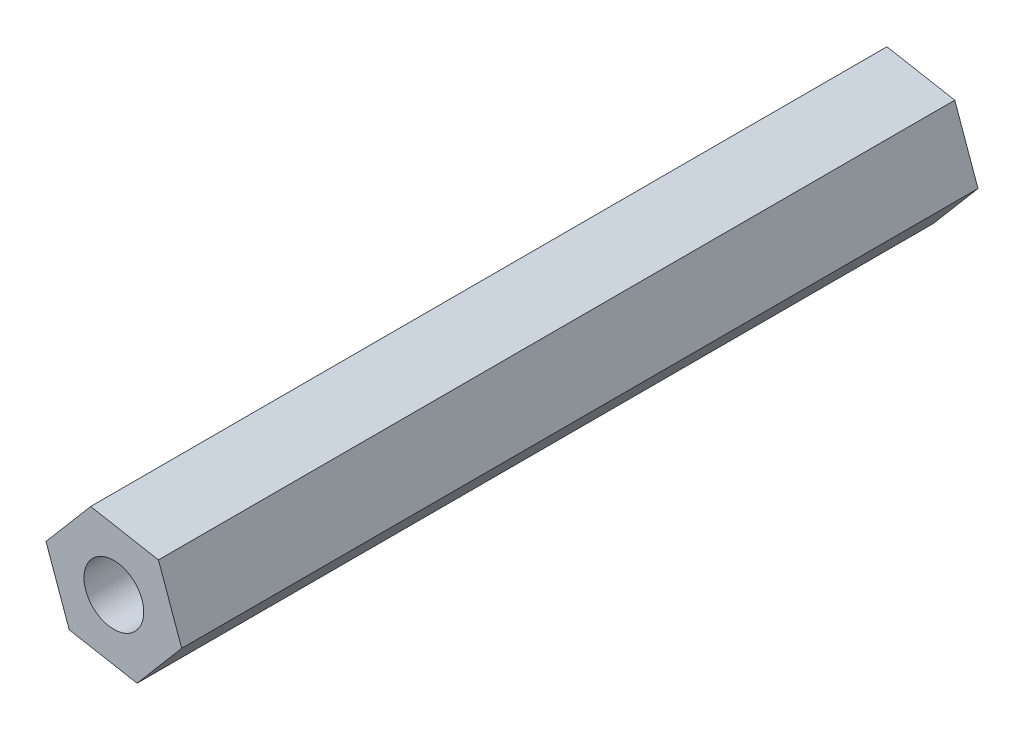
ISO-10303-21;
HEADER;
FILE_DESCRIPTION(('STEP AP214'),'2;1');
FILE_NAME('part.step','',(''),(''),'','','');
FILE_SCHEMA(('AUTOMOTIVE_DESIGN { 1 0 10303 214 1 1 1 1 }'));
ENDSEC;
DATA;
#1=APPLICATION_CONTEXT('core data for automotive mechanical design processes');
#2=APPLICATION_PROTOCOL_DEFINITION('international standard','automotive_design',2000,#1);
#3=PRODUCT_CONTEXT('',#1,'mechanical');
#4=PRODUCT('Part','Part','',(#3));
#5=PRODUCT_RELATED_PRODUCT_CATEGORY('part','',(#4));
#6=PRODUCT_DEFINITION_FORMATION('','',#4);
#7=PRODUCT_DEFINITION_CONTEXT('part definition',#1,'design');
#8=PRODUCT_DEFINITION('design','',#6,#7);
#9=PRODUCT_DEFINITION_SHAPE('','',#8);
#10=(LENGTH_UNIT() NAMED_UNIT(*) SI_UNIT(.MILLI.,.METRE.));
#11=(NAMED_UNIT(*) PLANE_ANGLE_UNIT() SI_UNIT($,.RADIAN.));
#12=(NAMED_UNIT(*) SI_UNIT($,.STERADIAN.) SOLID_ANGLE_UNIT());
#13=UNCERTAINTY_MEASURE_WITH_UNIT(LENGTH_MEASURE(1.E-05),#10,'distance_accuracy_value','');
#14=(GEOMETRIC_REPRESENTATION_CONTEXT(3) GLOBAL_UNCERTAINTY_ASSIGNED_CONTEXT((#13)) GLOBAL_UNIT_ASSIGNED_CONTEXT((#10,
#11,#12)) REPRESENTATION_CONTEXT('',''));
#15=CARTESIAN_POINT('',(0.,0.,0.));
#16=DIRECTION('',(0.,0.,1.));
#17=DIRECTION('',(1.,0.,0.));
#18=AXIS2_PLACEMENT_3D('',#15,#16,#17);
#19=CARTESIAN_POINT('',(14.100105118259,-7.40552271774973,40.));
#20=DIRECTION('',(-0.941553473498977,-0.336863557753005,0.));
#21=DIRECTION('',(0.336863557753005,-0.941553473498977,0.));
#22=AXIS2_PLACEMENT_3D('',#19,#20,#21);
#23=PLANE('',#22);
#24=DIRECTION('',(-0.336863557753005,0.941553473498977,0.));
#25=VECTOR('',#24,1.);
#26=CARTESIAN_POINT('',(14.100105118259,-7.40552271774973,0.));
#27=LINE('',#26,#25);
#28=CARTESIAN_POINT('',(14.100105118259,-7.40552271774973,0.));
#29=VERTEX_POINT('',#28);
#30=CARTESIAN_POINT('',(12.9331755237658,-4.14388580946336,0.));
#31=VERTEX_POINT('',#30);
#32=EDGE_CURVE('E117',#29,#31,#27,.T.);
#33=ORIENTED_EDGE('',*,*,#32,.T.);
#34=DIRECTION('',(0.,0.,-1.));
#35=VECTOR('',#34,1.);
#36=CARTESIAN_POINT('',(12.9331755237658,-4.14388580946336,40.));
#37=LINE('',#36,#35);
#38=CARTESIAN_POINT('',(12.9331755237658,-4.14388580946336,40.));
#39=VERTEX_POINT('',#38);
#40=EDGE_CURVE('E11',#39,#31,#37,.T.);
#41=ORIENTED_EDGE('',*,*,#40,.F.);
#42=DIRECTION('',(-0.336863557753005,0.941553473498977,0.));
#43=VECTOR('',#42,1.);
#44=CARTESIAN_POINT('',(14.100105118259,-7.40552271774973,40.));
#45=LINE('',#44,#43);
#46=CARTESIAN_POINT('',(14.100105118259,-7.40552271774973,40.));
#47=VERTEX_POINT('',#46);
#48=EDGE_CURVE('E128',#47,#39,#45,.T.);
#49=ORIENTED_EDGE('',*,*,#48,.F.);
#50=DIRECTION('',(0.,0.,-1.));
#51=VECTOR('',#50,1.);
#52=CARTESIAN_POINT('',(14.100105118259,-7.40552271774973,40.));
#53=LINE('',#52,#51);
#54=EDGE_CURVE('E113',#47,#29,#53,.T.);
#55=ORIENTED_EDGE('',*,*,#54,.T.);
#56=EDGE_LOOP('',(#33,#41,#49,#55));
#57=FACE_BOUND('',#56,.T.);
#58=ADVANCED_FACE('F33',(#57),#23,.F.);
#59=CARTESIAN_POINT('',(12.9331755237658,-4.14388580946336,40.));
#60=DIRECTION('',(-0.17904433812618,-0.983841005948094,0.));
#61=DIRECTION('',(0.983841005948094,-0.17904433812618,0.));
#62=AXIS2_PLACEMENT_3D('',#59,#60,#61);
#63=PLANE('',#62);
#64=DIRECTION('',(-0.983841005948094,0.17904433812618,0.));
#65=VECTOR('',#64,1.);
#66=CARTESIAN_POINT('',(12.9331755237658,-4.14388580946336,0.));
#67=LINE('',#66,#65);
#68=CARTESIAN_POINT('',(9.52505030602222,-3.52365802857919,0.));
#69=VERTEX_POINT('',#68);
#70=EDGE_CURVE('E120',#31,#69,#67,.T.);
#71=ORIENTED_EDGE('',*,*,#70,.T.);
#72=DIRECTION('',(0.,0.,-1.));
#73=VECTOR('',#72,1.);
#74=CARTESIAN_POINT('',(9.52505030602222,-3.52365802857919,40.));
#75=LINE('',#74,#73);
#76=CARTESIAN_POINT('',(9.52505030602222,-3.52365802857919,40.));
#77=VERTEX_POINT('',#76);
#78=EDGE_CURVE('E41',#77,#69,#75,.T.);
#79=ORIENTED_EDGE('',*,*,#78,.F.);
#80=DIRECTION('',(-0.983841005948094,0.17904433812618,0.));
#81=VECTOR('',#80,1.);
#82=CARTESIAN_POINT('',(12.9331755237658,-4.14388580946336,40.));
#83=LINE('',#82,#81);
#84=EDGE_CURVE('E86',#39,#77,#83,.T.);
#85=ORIENTED_EDGE('',*,*,#84,.F.);
#86=ORIENTED_EDGE('',*,*,#40,.T.);
#87=EDGE_LOOP('',(#71,#79,#85,#86));
#88=FACE_BOUND('',#87,.T.);
#89=ADVANCED_FACE('F153',(#88),#63,.F.);
#90=CARTESIAN_POINT('',(9.52505030602222,-3.52365802857919,40.));
#91=DIRECTION('',(0.762509135372797,-0.64697744819509,0.));
#92=DIRECTION('',(0.64697744819509,0.762509135372797,0.));
#93=AXIS2_PLACEMENT_3D('',#90,#91,#92);
#94=PLANE('',#93);
#95=DIRECTION('',(-0.64697744819509,-0.762509135372797,0.));
#96=VECTOR('',#95,1.);
#97=CARTESIAN_POINT('',(9.52505030602222,-3.52365802857919,0.));
#98=LINE('',#97,#96);
#99=CARTESIAN_POINT('',(7.28385468277191,-6.16506715598138,0.));
#100=VERTEX_POINT('',#99);
#101=EDGE_CURVE('E123',#69,#100,#98,.T.);
#102=ORIENTED_EDGE('',*,*,#101,.T.);
#103=DIRECTION('',(0.,0.,-1.));
#104=VECTOR('',#103,1.);
#105=CARTESIAN_POINT('',(7.28385468277191,-6.16506715598138,40.));
#106=LINE('',#105,#104);
#107=CARTESIAN_POINT('',(7.28385468277191,-6.16506715598138,40.));
#108=VERTEX_POINT('',#107);
#109=EDGE_CURVE('E108',#108,#100,#106,.T.);
#110=ORIENTED_EDGE('',*,*,#109,.F.);
#111=DIRECTION('',(-0.64697744819509,-0.762509135372797,0.));
#112=VECTOR('',#111,1.);
#113=CARTESIAN_POINT('',(9.52505030602222,-3.52365802857919,40.));
#114=LINE('',#113,#112);
#115=EDGE_CURVE('E99',#77,#108,#114,.T.);
#116=ORIENTED_EDGE('',*,*,#115,.F.);
#117=ORIENTED_EDGE('',*,*,#78,.T.);
#118=EDGE_LOOP('',(#102,#110,#116,#117));
#119=FACE_BOUND('',#118,.T.);
#120=ADVANCED_FACE('F134',(#119),#94,.F.);
#121=CARTESIAN_POINT('',(7.28385468277191,-6.16506715598138,40.));
#122=DIRECTION('',(0.941553473498977,0.336863557753005,0.));
#123=DIRECTION('',(-0.336863557753005,0.941553473498977,0.));
#124=AXIS2_PLACEMENT_3D('',#121,#122,#123);
#125=PLANE('',#124);
#126=DIRECTION('',(0.336863557753005,-0.941553473498977,0.));
#127=VECTOR('',#126,1.);
#128=CARTESIAN_POINT('',(7.28385468277191,-6.16506715598138,0.));
#129=LINE('',#128,#127);
#130=CARTESIAN_POINT('',(8.45078427726515,-9.42670406426776,0.));
#131=VERTEX_POINT('',#130);
#132=EDGE_CURVE('E107',#100,#131,#129,.T.);
#133=ORIENTED_EDGE('',*,*,#132,.T.);
#134=DIRECTION('',(0.,0.,-1.));
#135=VECTOR('',#134,1.);
#136=CARTESIAN_POINT('',(8.45078427726515,-9.42670406426776,40.));
#137=LINE('',#136,#135);
#138=CARTESIAN_POINT('',(8.45078427726515,-9.42670406426776,40.));
#139=VERTEX_POINT('',#138);
#140=EDGE_CURVE('E104',#139,#131,#137,.T.);
#141=ORIENTED_EDGE('',*,*,#140,.F.);
#142=DIRECTION('',(0.336863557753005,-0.941553473498977,0.));
#143=VECTOR('',#142,1.);
#144=CARTESIAN_POINT('',(7.28385468277191,-6.16506715598138,40.));
#145=LINE('',#144,#143);
#146=EDGE_CURVE('E93',#108,#139,#145,.T.);
#147=ORIENTED_EDGE('',*,*,#146,.F.);
#148=ORIENTED_EDGE('',*,*,#109,.T.);
#149=EDGE_LOOP('',(#133,#141,#147,#148));
#150=FACE_BOUND('',#149,.T.);
#151=ADVANCED_FACE('F105',(#150),#125,.F.);
#152=CARTESIAN_POINT('',(8.45078427726515,-9.42670406426776,40.));
#153=DIRECTION('',(0.17904433812618,0.983841005948094,0.));
#154=DIRECTION('',(-0.983841005948094,0.17904433812618,0.));
#155=AXIS2_PLACEMENT_3D('',#152,#153,#154);
#156=PLANE('',#155);
#157=DIRECTION('',(0.983841005948094,-0.17904433812618,0.));
#158=VECTOR('',#157,1.);
#159=CARTESIAN_POINT('',(8.45078427726515,-9.42670406426776,0.));
#160=LINE('',#159,#158);
#161=CARTESIAN_POINT('',(11.8589094950087,-10.0469318451519,0.));
#162=VERTEX_POINT('',#161);
#163=EDGE_CURVE('E72',#131,#162,#160,.T.);
#164=ORIENTED_EDGE('',*,*,#163,.T.);
#165=DIRECTION('',(0.,0.,-1.));
#166=VECTOR('',#165,1.);
#167=CARTESIAN_POINT('',(11.8589094950087,-10.0469318451519,40.));
#168=LINE('',#167,#166);
#169=CARTESIAN_POINT('',(11.8589094950087,-10.0469318451519,40.));
#170=VERTEX_POINT('',#169);
#171=EDGE_CURVE('E109',#170,#162,#168,.T.);
#172=ORIENTED_EDGE('',*,*,#171,.F.);
#173=DIRECTION('',(0.983841005948094,-0.17904433812618,0.));
#174=VECTOR('',#173,1.);
#175=CARTESIAN_POINT('',(8.45078427726515,-9.42670406426776,40.));
#176=LINE('',#175,#174);
#177=EDGE_CURVE('E97',#139,#170,#176,.T.);
#178=ORIENTED_EDGE('',*,*,#177,.F.);
#179=ORIENTED_EDGE('',*,*,#140,.T.);
#180=EDGE_LOOP('',(#164,#172,#178,#179));
#181=FACE_BOUND('',#180,.T.);
#182=ADVANCED_FACE('F111',(#181),#156,.F.);
#183=CARTESIAN_POINT('',(11.8589094950087,-10.0469318451519,40.));
#184=DIRECTION('',(-0.762509135372797,0.64697744819509,0.));
#185=DIRECTION('',(-0.64697744819509,-0.762509135372797,0.));
#186=AXIS2_PLACEMENT_3D('',#183,#184,#185);
#187=PLANE('',#186);
#188=DIRECTION('',(0.64697744819509,0.762509135372797,0.));
#189=VECTOR('',#188,1.);
#190=CARTESIAN_POINT('',(11.8589094950087,-10.0469318451519,0.));
#191=LINE('',#190,#189);
#192=EDGE_CURVE('E78',#162,#29,#191,.T.);
#193=ORIENTED_EDGE('',*,*,#192,.T.);
#194=ORIENTED_EDGE('',*,*,#54,.F.);
#195=DIRECTION('',(0.64697744819509,0.762509135372797,0.));
#196=VECTOR('',#195,1.);
#197=CARTESIAN_POINT('',(11.8589094950087,-10.0469318451519,40.));
#198=LINE('',#197,#196);
#199=EDGE_CURVE('E49',#170,#47,#198,.T.);
#200=ORIENTED_EDGE('',*,*,#199,.F.);
#201=ORIENTED_EDGE('',*,*,#171,.T.);
#202=EDGE_LOOP('',(#193,#194,#200,#201));
#203=FACE_BOUND('',#202,.T.);
#204=ADVANCED_FACE('F141',(#203),#187,.F.);
#205=CARTESIAN_POINT('',(0.,0.,40.));
#206=DIRECTION('',(0.,0.,1.));
#207=DIRECTION('',(1.,0.,0.));
#208=AXIS2_PLACEMENT_3D('',#205,#206,#207);
#209=PLANE('',#208);
#210=CARTESIAN_POINT('',(10.6919799005155,-6.78529493686556,40.));
#211=DIRECTION('',(0.,0.,-1.));
#212=DIRECTION('',(-1.,0.,0.));
#213=AXIS2_PLACEMENT_3D('',#210,#211,#212);
#214=CIRCLE('',#213,1.5);
#215=CARTESIAN_POINT('',(9.19197990051546,-6.78529493686556,40.));
#216=VERTEX_POINT('',#215);
#217=EDGE_CURVE('E121',#216,#216,#214,.T.);
#218=ORIENTED_EDGE('',*,*,#217,.T.);
#219=EDGE_LOOP('',(#218));
#220=FACE_BOUND('',#219,.T.);
#221=ORIENTED_EDGE('',*,*,#48,.T.);
#222=ORIENTED_EDGE('',*,*,#84,.T.);
#223=ORIENTED_EDGE('',*,*,#115,.T.);
#224=ORIENTED_EDGE('',*,*,#146,.T.);
#225=ORIENTED_EDGE('',*,*,#177,.T.);
#226=ORIENTED_EDGE('',*,*,#199,.T.);
#227=EDGE_LOOP('',(#221,#222,#223,#224,#225,#226));
#228=FACE_BOUND('',#227,.T.);
#229=ADVANCED_FACE('F95',(#220,#228),#209,.T.);
#230=CARTESIAN_POINT('',(0.,0.,0.));
#231=DIRECTION('',(0.,0.,1.));
#232=DIRECTION('',(1.,0.,0.));
#233=AXIS2_PLACEMENT_3D('',#230,#231,#232);
#234=PLANE('',#233);
#235=CARTESIAN_POINT('',(10.6919799005155,-6.78529493686556,0.));
#236=DIRECTION('',(0.,0.,-1.));
#237=DIRECTION('',(-1.,0.,0.));
#238=AXIS2_PLACEMENT_3D('',#235,#236,#237);
#239=CIRCLE('',#238,1.5);
#240=CARTESIAN_POINT('',(9.19197990051546,-6.78529493686556,0.));
#241=VERTEX_POINT('',#240);
#242=EDGE_CURVE('E208',#241,#241,#239,.T.);
#243=ORIENTED_EDGE('',*,*,#242,.F.);
#244=EDGE_LOOP('',(#243));
#245=FACE_BOUND('',#244,.T.);
#246=ORIENTED_EDGE('',*,*,#32,.F.);
#247=ORIENTED_EDGE('',*,*,#192,.F.);
#248=ORIENTED_EDGE('',*,*,#163,.F.);
#249=ORIENTED_EDGE('',*,*,#132,.F.);
#250=ORIENTED_EDGE('',*,*,#101,.F.);
#251=ORIENTED_EDGE('',*,*,#70,.F.);
#252=EDGE_LOOP('',(#246,#247,#248,#249,#250,#251));
#253=FACE_BOUND('',#252,.T.);
#254=ADVANCED_FACE('F137',(#245,#253),#234,.F.);
#255=CARTESIAN_POINT('',(10.6919799005155,-6.78529493686556,40.));
#256=DIRECTION('',(0.,0.,-1.));
#257=DIRECTION('',(-1.,0.,0.));
#258=AXIS2_PLACEMENT_3D('',#255,#256,#257);
#259=CYLINDRICAL_SURFACE('',#258,1.5);
#260=ORIENTED_EDGE('',*,*,#217,.F.);
#261=EDGE_LOOP('',(#260));
#262=FACE_BOUND('',#261,.T.);
#263=ORIENTED_EDGE('',*,*,#242,.T.);
#264=EDGE_LOOP('',(#263));
#265=FACE_BOUND('',#264,.T.);
#266=ADVANCED_FACE('F190',(#262,#265),#259,.F.);
#267=CLOSED_SHELL('',(#58,#89,#120,#151,#182,#204,#229,#254,#266));
#268=MANIFOLD_SOLID_BREP('B2',#267);
#269=ADVANCED_BREP_SHAPE_REPRESENTATION('',(#18,#268),#14);
#270=SHAPE_DEFINITION_REPRESENTATION(#9,#269);
ENDSEC;
END-ISO-10303-21;
